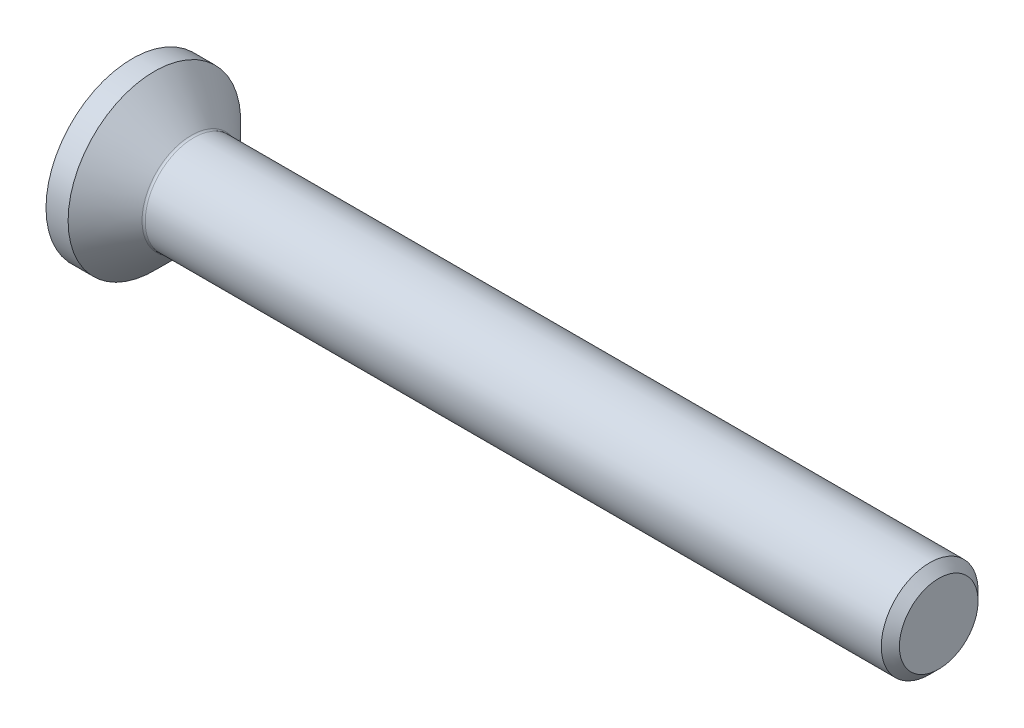
ISO-10303-21;
HEADER;
FILE_DESCRIPTION(('STEP AP214'),'2;1');
FILE_NAME('part.step','',(''),(''),'','','');
FILE_SCHEMA(('AUTOMOTIVE_DESIGN { 1 0 10303 214 1 1 1 1 }'));
ENDSEC;
DATA;
#1=APPLICATION_CONTEXT('core data for automotive mechanical design processes');
#2=APPLICATION_PROTOCOL_DEFINITION('international standard','automotive_design',2000,#1);
#3=PRODUCT_CONTEXT('',#1,'mechanical');
#4=PRODUCT('Part','Part','',(#3));
#5=PRODUCT_RELATED_PRODUCT_CATEGORY('part','',(#4));
#6=PRODUCT_DEFINITION_FORMATION('','',#4);
#7=PRODUCT_DEFINITION_CONTEXT('part definition',#1,'design');
#8=PRODUCT_DEFINITION('design','',#6,#7);
#9=PRODUCT_DEFINITION_SHAPE('','',#8);
#10=(LENGTH_UNIT() NAMED_UNIT(*) SI_UNIT(.MILLI.,.METRE.));
#11=(NAMED_UNIT(*) PLANE_ANGLE_UNIT() SI_UNIT($,.RADIAN.));
#12=(NAMED_UNIT(*) SI_UNIT($,.STERADIAN.) SOLID_ANGLE_UNIT());
#13=UNCERTAINTY_MEASURE_WITH_UNIT(LENGTH_MEASURE(1.E-05),#10,'distance_accuracy_value','');
#14=(GEOMETRIC_REPRESENTATION_CONTEXT(3) GLOBAL_UNCERTAINTY_ASSIGNED_CONTEXT((#13)) GLOBAL_UNIT_ASSIGNED_CONTEXT((#10,
#11,#12)) REPRESENTATION_CONTEXT('',''));
#15=CARTESIAN_POINT('',(0.,0.,0.));
#16=DIRECTION('',(0.,0.,1.));
#17=DIRECTION('',(1.,0.,0.));
#18=AXIS2_PLACEMENT_3D('',#15,#16,#17);
#19=CARTESIAN_POINT('',(0.,0.,0.));
#20=DIRECTION('',(-1.,0.,0.));
#21=DIRECTION('',(0.,0.,1.));
#22=AXIS2_PLACEMENT_3D('',#19,#20,#21);
#23=PLANE('',#22);
#24=CARTESIAN_POINT('',(0.,0.,0.));
#25=DIRECTION('',(-1.,0.,0.));
#26=DIRECTION('',(0.,0.,1.));
#27=AXIS2_PLACEMENT_3D('',#24,#25,#26);
#28=CIRCLE('',#27,2.675);
#29=CARTESIAN_POINT('',(0.,0.,2.675));
#30=VERTEX_POINT('',#29);
#31=EDGE_CURVE('E155',#30,#30,#28,.T.);
#32=ORIENTED_EDGE('',*,*,#31,.T.);
#33=EDGE_LOOP('',(#32));
#34=FACE_BOUND('',#33,.T.);
#35=DIRECTION('',(0.,-0.499999999999998,-0.86602540378444));
#36=VECTOR('',#35,1.);
#37=CARTESIAN_POINT('',(0.,-0.577350269189626,1.));
#38=LINE('',#37,#36);
#39=CARTESIAN_POINT('',(0.,-0.577350269189626,1.));
#40=VERTEX_POINT('',#39);
#41=CARTESIAN_POINT('',(0.,-1.15470053837925,0.));
#42=VERTEX_POINT('',#41);
#43=EDGE_CURVE('E121',#40,#42,#38,.T.);
#44=ORIENTED_EDGE('',*,*,#43,.T.);
#45=DIRECTION('',(0.,0.499999999999999,-0.866025403784439));
#46=VECTOR('',#45,1.);
#47=CARTESIAN_POINT('',(0.,-1.15470053837925,0.));
#48=LINE('',#47,#46);
#49=CARTESIAN_POINT('',(0.,-0.577350269189625,-1.));
#50=VERTEX_POINT('',#49);
#51=EDGE_CURVE('E52',#42,#50,#48,.T.);
#52=ORIENTED_EDGE('',*,*,#51,.T.);
#53=DIRECTION('',(0.,1.,0.));
#54=VECTOR('',#53,1.);
#55=CARTESIAN_POINT('',(0.,-0.577350269189625,-1.));
#56=LINE('',#55,#54);
#57=CARTESIAN_POINT('',(0.,0.577350269189626,-1.));
#58=VERTEX_POINT('',#57);
#59=EDGE_CURVE('E132',#50,#58,#56,.T.);
#60=ORIENTED_EDGE('',*,*,#59,.T.);
#61=DIRECTION('',(0.,0.5,0.866025403784439));
#62=VECTOR('',#61,1.);
#63=CARTESIAN_POINT('',(0.,0.577350269189626,-1.));
#64=LINE('',#63,#62);
#65=CARTESIAN_POINT('',(0.,1.15470053837925,0.));
#66=VERTEX_POINT('',#65);
#67=EDGE_CURVE('E256',#58,#66,#64,.T.);
#68=ORIENTED_EDGE('',*,*,#67,.T.);
#69=DIRECTION('',(0.,-0.499999999999999,0.866025403784439));
#70=VECTOR('',#69,1.);
#71=CARTESIAN_POINT('',(0.,1.15470053837925,0.));
#72=LINE('',#71,#70);
#73=CARTESIAN_POINT('',(0.,0.577350269189625,0.999999999999999));
#74=VERTEX_POINT('',#73);
#75=EDGE_CURVE('E259',#66,#74,#72,.T.);
#76=ORIENTED_EDGE('',*,*,#75,.T.);
#77=DIRECTION('',(0.,-1.,0.));
#78=VECTOR('',#77,1.);
#79=CARTESIAN_POINT('',(0.,0.577350269189625,0.999999999999999));
#80=LINE('',#79,#78);
#81=EDGE_CURVE('E262',#74,#40,#80,.T.);
#82=ORIENTED_EDGE('',*,*,#81,.T.);
#83=EDGE_LOOP('',(#44,#52,#60,#68,#76,#82));
#84=FACE_BOUND('',#83,.T.);
#85=ADVANCED_FACE('F37',(#34,#84),#23,.T.);
#86=CARTESIAN_POINT('',(0.,0.,0.));
#87=DIRECTION('',(-1.,0.,0.));
#88=DIRECTION('',(0.,0.,1.));
#89=AXIS2_PLACEMENT_3D('',#86,#87,#88);
#90=CYLINDRICAL_SURFACE('',#89,2.675);
#91=CARTESIAN_POINT('',(0.685000000000012,0.,0.));
#92=DIRECTION('',(-1.,0.,0.));
#93=DIRECTION('',(0.,0.,1.));
#94=AXIS2_PLACEMENT_3D('',#91,#92,#93);
#95=CIRCLE('',#94,2.675);
#96=CARTESIAN_POINT('',(0.685000000000012,0.,2.675));
#97=VERTEX_POINT('',#96);
#98=EDGE_CURVE('E152',#97,#97,#95,.T.);
#99=ORIENTED_EDGE('',*,*,#98,.T.);
#100=EDGE_LOOP('',(#99));
#101=FACE_BOUND('',#100,.T.);
#102=ORIENTED_EDGE('',*,*,#31,.F.);
#103=EDGE_LOOP('',(#102));
#104=FACE_BOUND('',#103,.T.);
#105=ADVANCED_FACE('F176',(#101,#104),#90,.T.);
#106=CARTESIAN_POINT('',(0.685000000000012,0.,0.));
#107=DIRECTION('',(-1.,0.,0.));
#108=DIRECTION('',(0.,0.,1.));
#109=AXIS2_PLACEMENT_3D('',#106,#107,#108);
#110=CONICAL_SURFACE('',#109,2.675,0.785398163397451);
#111=CARTESIAN_POINT('',(1.8307106781187,0.,0.));
#112=DIRECTION('',(-1.,0.,0.));
#113=DIRECTION('',(0.,0.,1.));
#114=AXIS2_PLACEMENT_3D('',#111,#112,#113);
#115=CIRCLE('',#114,1.52928932188131);
#116=CARTESIAN_POINT('',(1.8307106781187,0.,1.52928932188131));
#117=VERTEX_POINT('',#116);
#118=EDGE_CURVE('E45',#117,#117,#115,.T.);
#119=ORIENTED_EDGE('',*,*,#118,.T.);
#120=EDGE_LOOP('',(#119));
#121=FACE_BOUND('',#120,.T.);
#122=ORIENTED_EDGE('',*,*,#98,.F.);
#123=EDGE_LOOP('',(#122));
#124=FACE_BOUND('',#123,.T.);
#125=ADVANCED_FACE('F160',(#121,#124),#110,.T.);
#126=CARTESIAN_POINT('',(0.,0.,0.));
#127=DIRECTION('',(-1.,0.,0.));
#128=DIRECTION('',(0.,0.,1.));
#129=AXIS2_PLACEMENT_3D('',#126,#127,#128);
#130=CYLINDRICAL_SURFACE('',#129,1.49999999999996);
#131=CARTESIAN_POINT('',(1.90142135623735,0.,0.));
#132=DIRECTION('',(-1.,0.,0.));
#133=DIRECTION('',(0.,0.,1.));
#134=AXIS2_PLACEMENT_3D('',#131,#132,#133);
#135=CIRCLE('',#134,1.49999999999996);
#136=CARTESIAN_POINT('',(1.90142135623735,0.,1.49999999999996));
#137=VERTEX_POINT('',#136);
#138=EDGE_CURVE('E11',#137,#137,#135,.F.);
#139=ORIENTED_EDGE('',*,*,#138,.T.);
#140=EDGE_LOOP('',(#139));
#141=FACE_BOUND('',#140,.T.);
#142=CARTESIAN_POINT('',(24.7194999999999,0.,0.));
#143=DIRECTION('',(-1.,0.,0.));
#144=DIRECTION('',(0.,0.,1.));
#145=AXIS2_PLACEMENT_3D('',#142,#143,#144);
#146=CIRCLE('',#145,1.49999999999993);
#147=CARTESIAN_POINT('',(24.7194999999999,0.,1.49999999999993));
#148=VERTEX_POINT('',#147);
#149=EDGE_CURVE('E149',#148,#148,#146,.T.);
#150=ORIENTED_EDGE('',*,*,#149,.T.);
#151=EDGE_LOOP('',(#150));
#152=FACE_BOUND('',#151,.T.);
#153=ADVANCED_FACE('F187',(#141,#152),#130,.T.);
#154=CARTESIAN_POINT('',(25.,0.,0.));
#155=DIRECTION('',(-1.,0.,0.));
#156=DIRECTION('',(0.,0.,1.));
#157=AXIS2_PLACEMENT_3D('',#154,#155,#156);
#158=CONICAL_SURFACE('',#157,1.2195,0.785398163397208);
#159=ORIENTED_EDGE('',*,*,#149,.F.);
#160=EDGE_LOOP('',(#159));
#161=FACE_BOUND('',#160,.T.);
#162=CARTESIAN_POINT('',(25.,0.,0.));
#163=DIRECTION('',(-1.,0.,0.));
#164=DIRECTION('',(0.,0.,1.));
#165=AXIS2_PLACEMENT_3D('',#162,#163,#164);
#166=CIRCLE('',#165,1.2195);
#167=CARTESIAN_POINT('',(25.,0.,1.2195));
#168=VERTEX_POINT('',#167);
#169=EDGE_CURVE('E145',#168,#168,#166,.T.);
#170=ORIENTED_EDGE('',*,*,#169,.T.);
#171=EDGE_LOOP('',(#170));
#172=FACE_BOUND('',#171,.T.);
#173=ADVANCED_FACE('F171',(#161,#172),#158,.T.);
#174=CARTESIAN_POINT('',(25.,1.2195,0.));
#175=DIRECTION('',(1.,0.,0.));
#176=DIRECTION('',(0.,0.,-1.));
#177=AXIS2_PLACEMENT_3D('',#174,#175,#176);
#178=PLANE('',#177);
#179=ORIENTED_EDGE('',*,*,#169,.F.);
#180=EDGE_LOOP('',(#179));
#181=FACE_BOUND('',#180,.T.);
#182=ADVANCED_FACE('F164',(#181),#178,.T.);
#183=CARTESIAN_POINT('',(1.90142135623735,0.,0.));
#184=DIRECTION('',(-1.,0.,0.));
#185=DIRECTION('',(0.,0.,1.));
#186=AXIS2_PLACEMENT_3D('',#183,#184,#185);
#187=TOROIDAL_SURFACE('',#186,1.59999999999997,0.1);
#188=ORIENTED_EDGE('',*,*,#138,.F.);
#189=EDGE_LOOP('',(#188));
#190=FACE_BOUND('',#189,.T.);
#191=ORIENTED_EDGE('',*,*,#118,.F.);
#192=EDGE_LOOP('',(#191));
#193=FACE_BOUND('',#192,.T.);
#194=ADVANCED_FACE('F39',(#190,#193),#187,.F.);
#195=CARTESIAN_POINT('',(1.1,-1.15470053837925,0.));
#196=DIRECTION('',(0.,0.866025403784439,0.499999999999999));
#197=DIRECTION('',(0.,-0.499999999999999,0.866025403784439));
#198=AXIS2_PLACEMENT_3D('',#195,#196,#197);
#199=PLANE('',#198);
#200=ORIENTED_EDGE('',*,*,#51,.F.);
#201=DIRECTION('',(-1.,0.,0.));
#202=VECTOR('',#201,1.);
#203=CARTESIAN_POINT('',(1.1,-1.15470053837925,0.));
#204=LINE('',#203,#202);
#205=CARTESIAN_POINT('',(1.1,-1.15470053837925,0.));
#206=VERTEX_POINT('',#205);
#207=EDGE_CURVE('E253',#206,#42,#204,.T.);
#208=ORIENTED_EDGE('',*,*,#207,.F.);
#209=DIRECTION('',(0.,0.499999999999999,-0.866025403784439));
#210=VECTOR('',#209,1.);
#211=CARTESIAN_POINT('',(1.1,-1.15470053837925,0.));
#212=LINE('',#211,#210);
#213=CARTESIAN_POINT('',(1.1,-0.866025403784438,-0.499999999999998));
#214=VERTEX_POINT('',#213);
#215=EDGE_CURVE('E117',#206,#214,#212,.T.);
#216=ORIENTED_EDGE('',*,*,#215,.T.);
#217=CARTESIAN_POINT('',(1.1,-0.577350269189625,-1.));
#218=VERTEX_POINT('',#217);
#219=EDGE_CURVE('E113',#214,#218,#212,.T.);
#220=ORIENTED_EDGE('',*,*,#219,.T.);
#221=DIRECTION('',(-1.,0.,0.));
#222=VECTOR('',#221,1.);
#223=CARTESIAN_POINT('',(1.1,-0.577350269189625,-1.));
#224=LINE('',#223,#222);
#225=EDGE_CURVE('E115',#218,#50,#224,.T.);
#226=ORIENTED_EDGE('',*,*,#225,.T.);
#227=EDGE_LOOP('',(#200,#208,#216,#220,#226));
#228=FACE_BOUND('',#227,.T.);
#229=ADVANCED_FACE('F114',(#228),#199,.T.);
#230=CARTESIAN_POINT('',(1.1,-0.577350269189625,-1.));
#231=DIRECTION('',(0.,0.,1.));
#232=DIRECTION('',(1.,0.,0.));
#233=AXIS2_PLACEMENT_3D('',#230,#231,#232);
#234=PLANE('',#233);
#235=ORIENTED_EDGE('',*,*,#59,.F.);
#236=ORIENTED_EDGE('',*,*,#225,.F.);
#237=DIRECTION('',(0.,1.,0.));
#238=VECTOR('',#237,1.);
#239=CARTESIAN_POINT('',(1.1,-0.577350269189625,-1.));
#240=LINE('',#239,#238);
#241=CARTESIAN_POINT('',(1.1,0.,-1.));
#242=VERTEX_POINT('',#241);
#243=EDGE_CURVE('E60',#218,#242,#240,.T.);
#244=ORIENTED_EDGE('',*,*,#243,.T.);
#245=CARTESIAN_POINT('',(1.1,0.577350269189626,-1.));
#246=VERTEX_POINT('',#245);
#247=EDGE_CURVE('E127',#242,#246,#240,.T.);
#248=ORIENTED_EDGE('',*,*,#247,.T.);
#249=DIRECTION('',(-1.,0.,0.));
#250=VECTOR('',#249,1.);
#251=CARTESIAN_POINT('',(1.1,0.577350269189626,-1.));
#252=LINE('',#251,#250);
#253=EDGE_CURVE('E134',#246,#58,#252,.T.);
#254=ORIENTED_EDGE('',*,*,#253,.T.);
#255=EDGE_LOOP('',(#235,#236,#244,#248,#254));
#256=FACE_BOUND('',#255,.T.);
#257=ADVANCED_FACE('F129',(#256),#234,.T.);
#258=CARTESIAN_POINT('',(1.1,0.577350269189626,-1.));
#259=DIRECTION('',(0.,-0.866025403784438,0.5));
#260=DIRECTION('',(0.,-0.5,-0.866025403784439));
#261=AXIS2_PLACEMENT_3D('',#258,#259,#260);
#262=PLANE('',#261);
#263=ORIENTED_EDGE('',*,*,#67,.F.);
#264=ORIENTED_EDGE('',*,*,#253,.F.);
#265=DIRECTION('',(0.,0.5,0.866025403784439));
#266=VECTOR('',#265,1.);
#267=CARTESIAN_POINT('',(1.1,0.577350269189626,-1.));
#268=LINE('',#267,#266);
#269=CARTESIAN_POINT('',(1.1,0.866025403784439,-0.5));
#270=VERTEX_POINT('',#269);
#271=EDGE_CURVE('E234',#246,#270,#268,.T.);
#272=ORIENTED_EDGE('',*,*,#271,.T.);
#273=CARTESIAN_POINT('',(1.1,1.15470053837925,0.));
#274=VERTEX_POINT('',#273);
#275=EDGE_CURVE('E126',#270,#274,#268,.T.);
#276=ORIENTED_EDGE('',*,*,#275,.T.);
#277=DIRECTION('',(-1.,0.,0.));
#278=VECTOR('',#277,1.);
#279=CARTESIAN_POINT('',(1.1,1.15470053837925,0.));
#280=LINE('',#279,#278);
#281=EDGE_CURVE('E140',#274,#66,#280,.T.);
#282=ORIENTED_EDGE('',*,*,#281,.T.);
#283=EDGE_LOOP('',(#263,#264,#272,#276,#282));
#284=FACE_BOUND('',#283,.T.);
#285=ADVANCED_FACE('F201',(#284),#262,.T.);
#286=CARTESIAN_POINT('',(1.1,1.15470053837925,0.));
#287=DIRECTION('',(0.,-0.866025403784439,-0.499999999999999));
#288=DIRECTION('',(0.,0.499999999999999,-0.866025403784439));
#289=AXIS2_PLACEMENT_3D('',#286,#287,#288);
#290=PLANE('',#289);
#291=ORIENTED_EDGE('',*,*,#75,.F.);
#292=ORIENTED_EDGE('',*,*,#281,.F.);
#293=DIRECTION('',(0.,-0.499999999999999,0.866025403784439));
#294=VECTOR('',#293,1.);
#295=CARTESIAN_POINT('',(1.1,1.15470053837925,0.));
#296=LINE('',#295,#294);
#297=CARTESIAN_POINT('',(1.1,0.866025403784438,0.499999999999999));
#298=VERTEX_POINT('',#297);
#299=EDGE_CURVE('E241',#274,#298,#296,.T.);
#300=ORIENTED_EDGE('',*,*,#299,.T.);
#301=CARTESIAN_POINT('',(1.1,0.577350269189625,0.999999999999999));
#302=VERTEX_POINT('',#301);
#303=EDGE_CURVE('E239',#298,#302,#296,.T.);
#304=ORIENTED_EDGE('',*,*,#303,.T.);
#305=DIRECTION('',(-1.,0.,0.));
#306=VECTOR('',#305,1.);
#307=CARTESIAN_POINT('',(1.1,0.577350269189625,0.999999999999999));
#308=LINE('',#307,#306);
#309=EDGE_CURVE('E271',#302,#74,#308,.T.);
#310=ORIENTED_EDGE('',*,*,#309,.T.);
#311=EDGE_LOOP('',(#291,#292,#300,#304,#310));
#312=FACE_BOUND('',#311,.T.);
#313=ADVANCED_FACE('F204',(#312),#290,.T.);
#314=CARTESIAN_POINT('',(1.1,0.577350269189625,0.999999999999999));
#315=DIRECTION('',(0.,0.,-1.));
#316=DIRECTION('',(0.,1.,0.));
#317=AXIS2_PLACEMENT_3D('',#314,#315,#316);
#318=PLANE('',#317);
#319=ORIENTED_EDGE('',*,*,#81,.F.);
#320=ORIENTED_EDGE('',*,*,#309,.F.);
#321=DIRECTION('',(0.,-1.,0.));
#322=VECTOR('',#321,1.);
#323=CARTESIAN_POINT('',(1.1,0.577350269189625,0.999999999999999));
#324=LINE('',#323,#322);
#325=CARTESIAN_POINT('',(1.1,0.,1.));
#326=VERTEX_POINT('',#325);
#327=EDGE_CURVE('E246',#302,#326,#324,.T.);
#328=ORIENTED_EDGE('',*,*,#327,.T.);
#329=CARTESIAN_POINT('',(1.1,-0.577350269189626,1.));
#330=VERTEX_POINT('',#329);
#331=EDGE_CURVE('E245',#326,#330,#324,.T.);
#332=ORIENTED_EDGE('',*,*,#331,.T.);
#333=DIRECTION('',(-1.,0.,0.));
#334=VECTOR('',#333,1.);
#335=CARTESIAN_POINT('',(1.1,-0.577350269189626,1.));
#336=LINE('',#335,#334);
#337=EDGE_CURVE('E268',#330,#40,#336,.T.);
#338=ORIENTED_EDGE('',*,*,#337,.T.);
#339=EDGE_LOOP('',(#319,#320,#328,#332,#338));
#340=FACE_BOUND('',#339,.T.);
#341=ADVANCED_FACE('F208',(#340),#318,.T.);
#342=CARTESIAN_POINT('',(1.1,-0.577350269189626,1.));
#343=DIRECTION('',(0.,0.86602540378444,-0.499999999999998));
#344=DIRECTION('',(0.,0.499999999999998,0.86602540378444));
#345=AXIS2_PLACEMENT_3D('',#342,#343,#344);
#346=PLANE('',#345);
#347=ORIENTED_EDGE('',*,*,#43,.F.);
#348=ORIENTED_EDGE('',*,*,#337,.F.);
#349=DIRECTION('',(0.,-0.499999999999998,-0.86602540378444));
#350=VECTOR('',#349,1.);
#351=CARTESIAN_POINT('',(1.1,-0.577350269189626,1.));
#352=LINE('',#351,#350);
#353=CARTESIAN_POINT('',(1.1,-0.866025403784439,0.499999999999997));
#354=VERTEX_POINT('',#353);
#355=EDGE_CURVE('E250',#330,#354,#352,.T.);
#356=ORIENTED_EDGE('',*,*,#355,.T.);
#357=EDGE_CURVE('E249',#354,#206,#352,.T.);
#358=ORIENTED_EDGE('',*,*,#357,.T.);
#359=ORIENTED_EDGE('',*,*,#207,.T.);
#360=EDGE_LOOP('',(#347,#348,#356,#358,#359));
#361=FACE_BOUND('',#360,.T.);
#362=ADVANCED_FACE('F212',(#361),#346,.T.);
#363=CARTESIAN_POINT('',(1.1,-0.577350269189626,-1.));
#364=DIRECTION('',(1.,0.,0.));
#365=DIRECTION('',(0.,0.,-1.));
#366=AXIS2_PLACEMENT_3D('',#363,#364,#365);
#367=PLANE('',#366);
#368=ORIENTED_EDGE('',*,*,#243,.F.);
#369=ORIENTED_EDGE('',*,*,#219,.F.);
#370=CARTESIAN_POINT('',(1.1,0.,0.));
#371=DIRECTION('',(-1.,0.,0.));
#372=DIRECTION('',(0.,0.,1.));
#373=AXIS2_PLACEMENT_3D('',#370,#371,#372);
#374=CIRCLE('',#373,1.);
#375=EDGE_CURVE('E124',#242,#214,#374,.T.);
#376=ORIENTED_EDGE('',*,*,#375,.F.);
#377=EDGE_LOOP('',(#368,#369,#376));
#378=FACE_BOUND('',#377,.T.);
#379=ADVANCED_FACE('F123',(#378),#367,.F.);
#380=ORIENTED_EDGE('',*,*,#215,.F.);
#381=ORIENTED_EDGE('',*,*,#357,.F.);
#382=EDGE_CURVE('E137',#214,#354,#374,.T.);
#383=ORIENTED_EDGE('',*,*,#382,.F.);
#384=EDGE_LOOP('',(#380,#381,#383));
#385=FACE_BOUND('',#384,.T.);
#386=ADVANCED_FACE('F218',(#385),#367,.F.);
#387=ORIENTED_EDGE('',*,*,#355,.F.);
#388=ORIENTED_EDGE('',*,*,#331,.F.);
#389=EDGE_CURVE('E133',#354,#326,#374,.T.);
#390=ORIENTED_EDGE('',*,*,#389,.F.);
#391=EDGE_LOOP('',(#387,#388,#390));
#392=FACE_BOUND('',#391,.T.);
#393=ADVANCED_FACE('F222',(#392),#367,.F.);
#394=ORIENTED_EDGE('',*,*,#327,.F.);
#395=ORIENTED_EDGE('',*,*,#303,.F.);
#396=EDGE_CURVE('E139',#326,#298,#374,.T.);
#397=ORIENTED_EDGE('',*,*,#396,.F.);
#398=EDGE_LOOP('',(#394,#395,#397));
#399=FACE_BOUND('',#398,.T.);
#400=ADVANCED_FACE('F230',(#399),#367,.F.);
#401=ORIENTED_EDGE('',*,*,#299,.F.);
#402=ORIENTED_EDGE('',*,*,#275,.F.);
#403=EDGE_CURVE('E146',#298,#270,#374,.T.);
#404=ORIENTED_EDGE('',*,*,#403,.F.);
#405=EDGE_LOOP('',(#401,#402,#404));
#406=FACE_BOUND('',#405,.T.);
#407=ADVANCED_FACE('F225',(#406),#367,.F.);
#408=ORIENTED_EDGE('',*,*,#271,.F.);
#409=ORIENTED_EDGE('',*,*,#247,.F.);
#410=EDGE_CURVE('E235',#270,#242,#374,.T.);
#411=ORIENTED_EDGE('',*,*,#410,.F.);
#412=EDGE_LOOP('',(#408,#409,#411));
#413=FACE_BOUND('',#412,.T.);
#414=ADVANCED_FACE('F196',(#413),#367,.F.);
#415=CARTESIAN_POINT('',(1.1,0.,0.));
#416=DIRECTION('',(-1.,0.,0.));
#417=DIRECTION('',(0.,0.,1.));
#418=AXIS2_PLACEMENT_3D('',#415,#416,#417);
#419=CONICAL_SURFACE('',#418,1.,1.04719755119659);
#420=CARTESIAN_POINT('',(1.67735026918963,0.,0.));
#421=VERTEX_POINT('',#420);
#422=VERTEX_LOOP('',#421);
#423=FACE_BOUND('',#422,.T.);
#424=ORIENTED_EDGE('',*,*,#396,.T.);
#425=ORIENTED_EDGE('',*,*,#403,.T.);
#426=ORIENTED_EDGE('',*,*,#410,.T.);
#427=ORIENTED_EDGE('',*,*,#375,.T.);
#428=ORIENTED_EDGE('',*,*,#382,.T.);
#429=ORIENTED_EDGE('',*,*,#389,.T.);
#430=EDGE_LOOP('',(#424,#425,#426,#427,#428,#429));
#431=FACE_BOUND('',#430,.T.);
#432=ADVANCED_FACE('F194',(#423,#431),#419,.F.);
#433=CLOSED_SHELL('',(#85,#105,#125,#153,#173,#182,#194,#229,#257,#285,#313,#341,#362,#379,#386,
#393,#400,#407,#414,#432));
#434=MANIFOLD_SOLID_BREP('B2',#433);
#435=ADVANCED_BREP_SHAPE_REPRESENTATION('',(#18,#434),#14);
#436=SHAPE_DEFINITION_REPRESENTATION(#9,#435);
ENDSEC;
END-ISO-10303-21;
